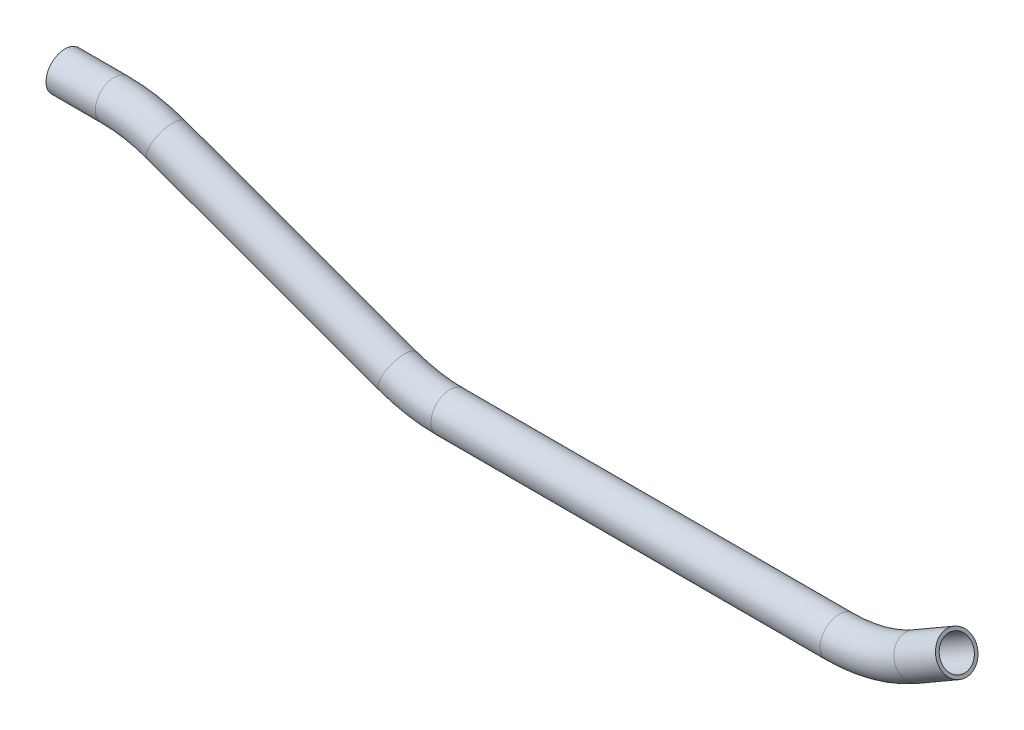
ISO-10303-21;
HEADER;
FILE_DESCRIPTION(('STEP AP214'),'2;1');
FILE_NAME('part.step','',(''),(''),'','','');
FILE_SCHEMA(('AUTOMOTIVE_DESIGN { 1 0 10303 214 1 1 1 1 }'));
ENDSEC;
DATA;
#1=APPLICATION_CONTEXT('core data for automotive mechanical design processes');
#2=APPLICATION_PROTOCOL_DEFINITION('international standard','automotive_design',2000,#1);
#3=PRODUCT_CONTEXT('',#1,'mechanical');
#4=PRODUCT('Part','Part','',(#3));
#5=PRODUCT_RELATED_PRODUCT_CATEGORY('part','',(#4));
#6=PRODUCT_DEFINITION_FORMATION('','',#4);
#7=PRODUCT_DEFINITION_CONTEXT('part definition',#1,'design');
#8=PRODUCT_DEFINITION('design','',#6,#7);
#9=PRODUCT_DEFINITION_SHAPE('','',#8);
#10=(LENGTH_UNIT() NAMED_UNIT(*) SI_UNIT(.MILLI.,.METRE.));
#11=(NAMED_UNIT(*) PLANE_ANGLE_UNIT() SI_UNIT($,.RADIAN.));
#12=(NAMED_UNIT(*) SI_UNIT($,.STERADIAN.) SOLID_ANGLE_UNIT());
#13=UNCERTAINTY_MEASURE_WITH_UNIT(LENGTH_MEASURE(1.E-05),#10,'distance_accuracy_value','');
#14=(GEOMETRIC_REPRESENTATION_CONTEXT(3) GLOBAL_UNCERTAINTY_ASSIGNED_CONTEXT((#13)) GLOBAL_UNIT_ASSIGNED_CONTEXT((#10,
#11,#12)) REPRESENTATION_CONTEXT('',''));
#15=CARTESIAN_POINT('',(0.,0.,0.));
#16=DIRECTION('',(0.,0.,1.));
#17=DIRECTION('',(1.,0.,0.));
#18=AXIS2_PLACEMENT_3D('',#15,#16,#17);
#19=CARTESIAN_POINT('',(-82.7154385844932,8.12520738670455,0.));
#20=DIRECTION('',(1.,0.,0.));
#21=DIRECTION('',(0.,1.,0.));
#22=AXIS2_PLACEMENT_3D('',#19,#20,#21);
#23=CYLINDRICAL_SURFACE('',#22,9.525);
#24=CARTESIAN_POINT('',(-58.0515545144782,8.12520738670464,0.));
#25=DIRECTION('',(1.,0.,0.));
#26=DIRECTION('',(0.,1.,0.));
#27=AXIS2_PLACEMENT_3D('',#24,#25,#26);
#28=CIRCLE('',#27,9.525);
#29=CARTESIAN_POINT('',(-58.0515545144782,17.6502073867044,0.));
#30=VERTEX_POINT('',#29);
#31=EDGE_CURVE('E56',#30,#30,#28,.T.);
#32=ORIENTED_EDGE('',*,*,#31,.F.);
#33=EDGE_LOOP('',(#32));
#34=FACE_BOUND('',#33,.T.);
#35=CARTESIAN_POINT('',(-82.7154385844932,8.12520738670455,0.));
#36=DIRECTION('',(1.,0.,0.));
#37=DIRECTION('',(0.,1.,0.));
#38=AXIS2_PLACEMENT_3D('',#35,#36,#37);
#39=CIRCLE('',#38,9.525);
#40=CARTESIAN_POINT('',(-82.7154385844932,17.6502073867046,0.));
#41=VERTEX_POINT('',#40);
#42=EDGE_CURVE('E53',#41,#41,#39,.T.);
#43=ORIENTED_EDGE('',*,*,#42,.T.);
#44=EDGE_LOOP('',(#43));
#45=FACE_BOUND('',#44,.T.);
#46=ADVANCED_FACE('F32',(#34,#45),#23,.T.);
#47=CARTESIAN_POINT('',(-58.0515545144782,-68.0747926132954,0.));
#48=DIRECTION('',(0.,0.,-1.));
#49=DIRECTION('',(-1.,0.,0.));
#50=AXIS2_PLACEMENT_3D('',#47,#48,#49);
#51=TOROIDAL_SURFACE('',#50,76.1999999999997,9.525);
#52=CARTESIAN_POINT('',(-31.9896195930622,3.52978509059085,0.));
#53=DIRECTION('',(0.939692620785907,-0.342020143325673,0.));
#54=DIRECTION('',(0.342020143325673,0.939692620785907,0.));
#55=AXIS2_PLACEMENT_3D('',#52,#53,#54);
#56=CIRCLE('',#55,9.525);
#57=CARTESIAN_POINT('',(-28.7318777278853,12.4803573035764,0.));
#58=VERTEX_POINT('',#57);
#59=EDGE_CURVE('E59',#58,#58,#56,.T.);
#60=CARTESIAN_POINT('',(-58.0515545144782,-68.0747926132954,0.));
#61=DIRECTION('',(0.,0.,-1.));
#62=DIRECTION('',(-1.,0.,0.));
#63=AXIS2_PLACEMENT_3D('',#60,#61,#62);
#64=CIRCLE('',#63,85.7249999999998);
#65=EDGE_CURVE('',#30,#58,#64,.T.);
#66=ORIENTED_EDGE('',*,*,#31,.T.);
#67=ORIENTED_EDGE('',*,*,#59,.F.);
#68=ORIENTED_EDGE('',*,*,#65,.T.);
#69=ORIENTED_EDGE('',*,*,#65,.F.);
#70=EDGE_LOOP('',(#66,#68,#67,#69));
#71=FACE_BOUND('',#70,.T.);
#72=ADVANCED_FACE('F110',(#71),#51,.T.);
#73=CARTESIAN_POINT('',(-31.9896195930622,3.52978509059085,0.));
#74=DIRECTION('',(0.939692620785908,-0.34202014332567,0.));
#75=DIRECTION('',(0.34202014332567,0.939692620785908,0.));
#76=AXIS2_PLACEMENT_3D('',#73,#74,#75);
#77=CYLINDRICAL_SURFACE('',#76,9.525);
#78=CARTESIAN_POINT('',(83.8823451929914,-38.6441610774744,0.));
#79=DIRECTION('',(0.939692620785907,-0.342020143325673,0.));
#80=DIRECTION('',(0.342020143325673,0.939692620785907,0.));
#81=AXIS2_PLACEMENT_3D('',#78,#79,#80);
#82=CIRCLE('',#81,9.525);
#83=CARTESIAN_POINT('',(80.6246033278144,-47.5947332904601,0.));
#84=VERTEX_POINT('',#83);
#85=EDGE_CURVE('E62',#84,#84,#82,.T.);
#86=ORIENTED_EDGE('',*,*,#85,.F.);
#87=EDGE_LOOP('',(#86));
#88=FACE_BOUND('',#87,.T.);
#89=ORIENTED_EDGE('',*,*,#59,.T.);
#90=EDGE_LOOP('',(#89));
#91=FACE_BOUND('',#90,.T.);
#92=ADVANCED_FACE('F114',(#88,#91),#77,.T.);
#93=CARTESIAN_POINT('',(109.944280114407,32.9604166264119,0.));
#94=DIRECTION('',(0.,0.,1.));
#95=DIRECTION('',(1.,0.,0.));
#96=AXIS2_PLACEMENT_3D('',#93,#94,#95);
#97=TOROIDAL_SURFACE('',#96,76.2,9.525);
#98=CARTESIAN_POINT('',(109.944280114407,-43.2395833735884,0.));
#99=DIRECTION('',(1.,0.,0.));
#100=DIRECTION('',(0.,1.,0.));
#101=AXIS2_PLACEMENT_3D('',#98,#99,#100);
#102=CIRCLE('',#101,9.525);
#103=CARTESIAN_POINT('',(109.944280114407,-52.7645833735882,0.));
#104=VERTEX_POINT('',#103);
#105=EDGE_CURVE('E65',#104,#104,#102,.T.);
#106=CARTESIAN_POINT('',(109.944280114407,32.9604166264119,0.));
#107=DIRECTION('',(0.,0.,1.));
#108=DIRECTION('',(1.,0.,0.));
#109=AXIS2_PLACEMENT_3D('',#106,#107,#108);
#110=CIRCLE('',#109,85.725);
#111=EDGE_CURVE('',#84,#104,#110,.T.);
#112=ORIENTED_EDGE('',*,*,#85,.T.);
#113=ORIENTED_EDGE('',*,*,#105,.F.);
#114=ORIENTED_EDGE('',*,*,#111,.T.);
#115=ORIENTED_EDGE('',*,*,#111,.F.);
#116=EDGE_LOOP('',(#112,#114,#113,#115));
#117=FACE_BOUND('',#116,.T.);
#118=ADVANCED_FACE('F84',(#117),#97,.T.);
#119=CARTESIAN_POINT('',(109.944280114407,-43.2395833735884,0.));
#120=DIRECTION('',(1.,0.,0.));
#121=DIRECTION('',(0.,1.,0.));
#122=AXIS2_PLACEMENT_3D('',#119,#120,#121);
#123=CYLINDRICAL_SURFACE('',#122,9.525);
#124=CARTESIAN_POINT('',(304.690435721171,-43.2395833735883,0.));
#125=DIRECTION('',(1.,0.,0.));
#126=DIRECTION('',(0.,1.,0.));
#127=AXIS2_PLACEMENT_3D('',#124,#125,#126);
#128=CIRCLE('',#127,9.525);
#129=CARTESIAN_POINT('',(304.690435721171,-52.7645833735883,0.));
#130=VERTEX_POINT('',#129);
#131=EDGE_CURVE('E67',#130,#130,#128,.T.);
#132=ORIENTED_EDGE('',*,*,#131,.F.);
#133=EDGE_LOOP('',(#132));
#134=FACE_BOUND('',#133,.T.);
#135=ORIENTED_EDGE('',*,*,#105,.T.);
#136=EDGE_LOOP('',(#135));
#137=FACE_BOUND('',#136,.T.);
#138=ADVANCED_FACE('F77',(#134,#137),#123,.T.);
#139=CARTESIAN_POINT('',(304.690435721171,32.9604166264119,0.));
#140=DIRECTION('',(0.,0.,1.));
#141=DIRECTION('',(1.,0.,0.));
#142=AXIS2_PLACEMENT_3D('',#139,#140,#141);
#143=TOROIDAL_SURFACE('',#142,76.2000000000002,9.525);
#144=CARTESIAN_POINT('',(342.790435721171,-33.0307191419622,0.));
#145=DIRECTION('',(0.866025403784439,0.499999999999999,0.));
#146=DIRECTION('',(-0.499999999999999,0.866025403784439,0.));
#147=AXIS2_PLACEMENT_3D('',#144,#145,#146);
#148=CIRCLE('',#147,9.525);
#149=CARTESIAN_POINT('',(347.552935721171,-41.2796111130092,0.));
#150=VERTEX_POINT('',#149);
#151=EDGE_CURVE('E36',#150,#150,#148,.T.);
#152=CARTESIAN_POINT('',(304.690435721171,32.9604166264119,0.));
#153=DIRECTION('',(0.,0.,1.));
#154=DIRECTION('',(1.,0.,0.));
#155=AXIS2_PLACEMENT_3D('',#152,#153,#154);
#156=CIRCLE('',#155,85.7250000000002);
#157=EDGE_CURVE('',#130,#150,#156,.T.);
#158=ORIENTED_EDGE('',*,*,#131,.T.);
#159=ORIENTED_EDGE('',*,*,#151,.F.);
#160=ORIENTED_EDGE('',*,*,#157,.T.);
#161=ORIENTED_EDGE('',*,*,#157,.F.);
#162=EDGE_LOOP('',(#158,#160,#159,#161));
#163=FACE_BOUND('',#162,.T.);
#164=ADVANCED_FACE('F75',(#163),#143,.T.);
#165=CARTESIAN_POINT('',(342.790435721171,-33.0307191419622,0.));
#166=DIRECTION('',(0.866025403784437,0.500000000000003,0.));
#167=DIRECTION('',(-0.500000000000003,0.866025403784437,0.));
#168=AXIS2_PLACEMENT_3D('',#165,#166,#167);
#169=CYLINDRICAL_SURFACE('',#168,9.525);
#170=CARTESIAN_POINT('',(363.602993382641,-21.014583373588,0.));
#171=DIRECTION('',(0.866025403784438,0.5,0.));
#172=DIRECTION('',(-0.5,0.866025403784438,0.));
#173=AXIS2_PLACEMENT_3D('',#170,#171,#172);
#174=CIRCLE('',#173,9.525);
#175=CARTESIAN_POINT('',(358.840493382641,-12.7656914025412,0.));
#176=VERTEX_POINT('',#175);
#177=EDGE_CURVE('E49',#176,#176,#174,.T.);
#178=ORIENTED_EDGE('',*,*,#177,.F.);
#179=EDGE_LOOP('',(#178));
#180=FACE_BOUND('',#179,.T.);
#181=ORIENTED_EDGE('',*,*,#151,.T.);
#182=EDGE_LOOP('',(#181));
#183=FACE_BOUND('',#182,.T.);
#184=ADVANCED_FACE('F34',(#180,#183),#169,.T.);
#185=CARTESIAN_POINT('',(-82.7154385844932,8.12520738670455,0.));
#186=DIRECTION('',(1.,0.,0.));
#187=DIRECTION('',(0.,1.,0.));
#188=AXIS2_PLACEMENT_3D('',#185,#186,#187);
#189=PLANE('',#188);
#190=CARTESIAN_POINT('',(-82.7154385844932,8.12520738670455,0.));
#191=DIRECTION('',(1.,0.,0.));
#192=DIRECTION('',(0.,1.,0.));
#193=AXIS2_PLACEMENT_3D('',#190,#191,#192);
#194=CIRCLE('',#193,7.874);
#195=CARTESIAN_POINT('',(-82.7154385844932,15.9992073867046,0.));
#196=VERTEX_POINT('',#195);
#197=EDGE_CURVE('E52',#196,#196,#194,.F.);
#198=ORIENTED_EDGE('',*,*,#197,.F.);
#199=EDGE_LOOP('',(#198));
#200=FACE_BOUND('',#199,.T.);
#201=ORIENTED_EDGE('',*,*,#42,.F.);
#202=EDGE_LOOP('',(#201));
#203=FACE_BOUND('',#202,.T.);
#204=ADVANCED_FACE('F82',(#200,#203),#189,.F.);
#205=CARTESIAN_POINT('',(363.602993382641,-21.014583373588,0.));
#206=DIRECTION('',(0.866025403784438,0.5,0.));
#207=DIRECTION('',(-0.5,0.866025403784438,0.));
#208=AXIS2_PLACEMENT_3D('',#205,#206,#207);
#209=PLANE('',#208);
#210=CARTESIAN_POINT('',(363.602993382641,-21.014583373588,0.));
#211=DIRECTION('',(0.866025403784438,0.5,0.));
#212=DIRECTION('',(-0.5,0.866025403784438,0.));
#213=AXIS2_PLACEMENT_3D('',#210,#211,#212);
#214=CIRCLE('',#213,7.874);
#215=CARTESIAN_POINT('',(359.665993382641,-14.1954993441893,0.));
#216=VERTEX_POINT('',#215);
#217=EDGE_CURVE('E10',#216,#216,#214,.F.);
#218=ORIENTED_EDGE('',*,*,#217,.T.);
#219=EDGE_LOOP('',(#218));
#220=FACE_BOUND('',#219,.T.);
#221=ORIENTED_EDGE('',*,*,#177,.T.);
#222=EDGE_LOOP('',(#221));
#223=FACE_BOUND('',#222,.T.);
#224=ADVANCED_FACE('F101',(#220,#223),#209,.T.);
#225=CARTESIAN_POINT('',(-82.7154385844932,8.12520738670455,0.));
#226=DIRECTION('',(1.,0.,0.));
#227=DIRECTION('',(0.,1.,0.));
#228=AXIS2_PLACEMENT_3D('',#225,#226,#227);
#229=CYLINDRICAL_SURFACE('',#228,7.874);
#230=CARTESIAN_POINT('',(-58.0515545144782,8.12520738670464,0.));
#231=DIRECTION('',(1.,0.,0.));
#232=DIRECTION('',(0.,1.,0.));
#233=AXIS2_PLACEMENT_3D('',#230,#231,#232);
#234=CIRCLE('',#233,7.874);
#235=CARTESIAN_POINT('',(-58.0515545144782,15.9992073867044,0.));
#236=VERTEX_POINT('',#235);
#237=EDGE_CURVE('E237',#236,#236,#234,.F.);
#238=ORIENTED_EDGE('',*,*,#237,.F.);
#239=EDGE_LOOP('',(#238));
#240=FACE_BOUND('',#239,.T.);
#241=ORIENTED_EDGE('',*,*,#197,.T.);
#242=EDGE_LOOP('',(#241));
#243=FACE_BOUND('',#242,.T.);
#244=ADVANCED_FACE('F104',(#240,#243),#229,.F.);
#245=CARTESIAN_POINT('',(-58.0515545144782,-68.0747926132954,0.));
#246=DIRECTION('',(0.,0.,-1.));
#247=DIRECTION('',(-1.,0.,0.));
#248=AXIS2_PLACEMENT_3D('',#245,#246,#247);
#249=TOROIDAL_SURFACE('',#248,76.1999999999997,7.874);
#250=CARTESIAN_POINT('',(-31.9896195930622,3.52978509059085,0.));
#251=DIRECTION('',(0.939692620785907,-0.342020143325673,0.));
#252=DIRECTION('',(0.342020143325673,0.939692620785907,0.));
#253=AXIS2_PLACEMENT_3D('',#250,#251,#252);
#254=CIRCLE('',#253,7.874);
#255=CARTESIAN_POINT('',(-29.296552984516,10.9289247866589,0.));
#256=VERTEX_POINT('',#255);
#257=EDGE_CURVE('E232',#256,#256,#254,.F.);
#258=CARTESIAN_POINT('',(-58.0515545144782,-68.0747926132954,0.));
#259=DIRECTION('',(0.,0.,-1.));
#260=DIRECTION('',(-1.,0.,0.));
#261=AXIS2_PLACEMENT_3D('',#258,#259,#260);
#262=CIRCLE('',#261,84.0739999999997);
#263=EDGE_CURVE('',#236,#256,#262,.T.);
#264=ORIENTED_EDGE('',*,*,#237,.T.);
#265=ORIENTED_EDGE('',*,*,#257,.F.);
#266=ORIENTED_EDGE('',*,*,#263,.T.);
#267=ORIENTED_EDGE('',*,*,#263,.F.);
#268=EDGE_LOOP('',(#264,#266,#265,#267));
#269=FACE_BOUND('',#268,.T.);
#270=ADVANCED_FACE('F171',(#269),#249,.F.);
#271=CARTESIAN_POINT('',(-31.9896195930622,3.52978509059085,0.));
#272=DIRECTION('',(0.939692620785908,-0.34202014332567,0.));
#273=DIRECTION('',(0.34202014332567,0.939692620785908,0.));
#274=AXIS2_PLACEMENT_3D('',#271,#272,#273);
#275=CYLINDRICAL_SURFACE('',#274,7.874);
#276=CARTESIAN_POINT('',(83.8823451929914,-38.6441610774744,0.));
#277=DIRECTION('',(0.939692620785907,-0.342020143325673,0.));
#278=DIRECTION('',(0.342020143325673,0.939692620785907,0.));
#279=AXIS2_PLACEMENT_3D('',#276,#277,#278);
#280=CIRCLE('',#279,7.874);
#281=CARTESIAN_POINT('',(81.189278584445,-46.0433007735426,0.));
#282=VERTEX_POINT('',#281);
#283=EDGE_CURVE('E229',#282,#282,#280,.F.);
#284=ORIENTED_EDGE('',*,*,#283,.F.);
#285=EDGE_LOOP('',(#284));
#286=FACE_BOUND('',#285,.T.);
#287=ORIENTED_EDGE('',*,*,#257,.T.);
#288=EDGE_LOOP('',(#287));
#289=FACE_BOUND('',#288,.T.);
#290=ADVANCED_FACE('F181',(#286,#289),#275,.F.);
#291=CARTESIAN_POINT('',(109.944280114407,32.9604166264119,0.));
#292=DIRECTION('',(0.,0.,1.));
#293=DIRECTION('',(1.,0.,0.));
#294=AXIS2_PLACEMENT_3D('',#291,#292,#293);
#295=TOROIDAL_SURFACE('',#294,76.2,7.874);
#296=CARTESIAN_POINT('',(109.944280114407,-43.2395833735884,0.));
#297=DIRECTION('',(1.,0.,0.));
#298=DIRECTION('',(0.,1.,0.));
#299=AXIS2_PLACEMENT_3D('',#296,#297,#298);
#300=CIRCLE('',#299,7.874);
#301=CARTESIAN_POINT('',(109.944280114407,-51.1135833735881,0.));
#302=VERTEX_POINT('',#301);
#303=EDGE_CURVE('E228',#302,#302,#300,.F.);
#304=CARTESIAN_POINT('',(109.944280114407,32.9604166264119,0.));
#305=DIRECTION('',(0.,0.,1.));
#306=DIRECTION('',(1.,0.,0.));
#307=AXIS2_PLACEMENT_3D('',#304,#305,#306);
#308=CIRCLE('',#307,84.074);
#309=EDGE_CURVE('',#282,#302,#308,.T.);
#310=ORIENTED_EDGE('',*,*,#283,.T.);
#311=ORIENTED_EDGE('',*,*,#303,.F.);
#312=ORIENTED_EDGE('',*,*,#309,.T.);
#313=ORIENTED_EDGE('',*,*,#309,.F.);
#314=EDGE_LOOP('',(#310,#312,#311,#313));
#315=FACE_BOUND('',#314,.T.);
#316=ADVANCED_FACE('F191',(#315),#295,.F.);
#317=CARTESIAN_POINT('',(109.944280114407,-43.2395833735884,0.));
#318=DIRECTION('',(1.,0.,0.));
#319=DIRECTION('',(0.,1.,0.));
#320=AXIS2_PLACEMENT_3D('',#317,#318,#319);
#321=CYLINDRICAL_SURFACE('',#320,7.874);
#322=CARTESIAN_POINT('',(304.690435721171,-43.2395833735883,0.));
#323=DIRECTION('',(1.,0.,0.));
#324=DIRECTION('',(0.,1.,0.));
#325=AXIS2_PLACEMENT_3D('',#322,#323,#324);
#326=CIRCLE('',#325,7.874);
#327=CARTESIAN_POINT('',(304.690435721171,-51.1135833735883,0.));
#328=VERTEX_POINT('',#327);
#329=EDGE_CURVE('E45',#328,#328,#326,.F.);
#330=ORIENTED_EDGE('',*,*,#329,.F.);
#331=EDGE_LOOP('',(#330));
#332=FACE_BOUND('',#331,.T.);
#333=ORIENTED_EDGE('',*,*,#303,.T.);
#334=EDGE_LOOP('',(#333));
#335=FACE_BOUND('',#334,.T.);
#336=ADVANCED_FACE('F95',(#332,#335),#321,.F.);
#337=CARTESIAN_POINT('',(304.690435721171,32.9604166264119,0.));
#338=DIRECTION('',(0.,0.,1.));
#339=DIRECTION('',(1.,0.,0.));
#340=AXIS2_PLACEMENT_3D('',#337,#338,#339);
#341=TOROIDAL_SURFACE('',#340,76.2000000000002,7.874);
#342=CARTESIAN_POINT('',(342.790435721171,-33.0307191419622,0.));
#343=DIRECTION('',(0.866025403784439,0.499999999999999,0.));
#344=DIRECTION('',(-0.499999999999999,0.866025403784439,0.));
#345=AXIS2_PLACEMENT_3D('',#342,#343,#344);
#346=CIRCLE('',#345,7.874);
#347=CARTESIAN_POINT('',(346.727435721171,-39.849803171361,0.));
#348=VERTEX_POINT('',#347);
#349=EDGE_CURVE('E40',#348,#348,#346,.F.);
#350=CARTESIAN_POINT('',(304.690435721171,32.9604166264119,0.));
#351=DIRECTION('',(0.,0.,1.));
#352=DIRECTION('',(1.,0.,0.));
#353=AXIS2_PLACEMENT_3D('',#350,#351,#352);
#354=CIRCLE('',#353,84.0740000000002);
#355=EDGE_CURVE('',#328,#348,#354,.T.);
#356=ORIENTED_EDGE('',*,*,#329,.T.);
#357=ORIENTED_EDGE('',*,*,#349,.F.);
#358=ORIENTED_EDGE('',*,*,#355,.T.);
#359=ORIENTED_EDGE('',*,*,#355,.F.);
#360=EDGE_LOOP('',(#356,#358,#357,#359));
#361=FACE_BOUND('',#360,.T.);
#362=ADVANCED_FACE('F89',(#361),#341,.F.);
#363=CARTESIAN_POINT('',(342.790435721171,-33.0307191419622,0.));
#364=DIRECTION('',(0.866025403784437,0.500000000000003,0.));
#365=DIRECTION('',(-0.500000000000003,0.866025403784437,0.));
#366=AXIS2_PLACEMENT_3D('',#363,#364,#365);
#367=CYLINDRICAL_SURFACE('',#366,7.874);
#368=ORIENTED_EDGE('',*,*,#217,.F.);
#369=EDGE_LOOP('',(#368));
#370=FACE_BOUND('',#369,.T.);
#371=ORIENTED_EDGE('',*,*,#349,.T.);
#372=EDGE_LOOP('',(#371));
#373=FACE_BOUND('',#372,.T.);
#374=ADVANCED_FACE('F87',(#370,#373),#367,.F.);
#375=CLOSED_SHELL('',(#46,#72,#92,#118,#138,#164,#184,#204,#224,#244,#270,#290,#316,#336,#362,#374));
#376=MANIFOLD_SOLID_BREP('B2',#375);
#377=ADVANCED_BREP_SHAPE_REPRESENTATION('',(#18,#376),#14);
#378=SHAPE_DEFINITION_REPRESENTATION(#9,#377);
ENDSEC;
END-ISO-10303-21;
